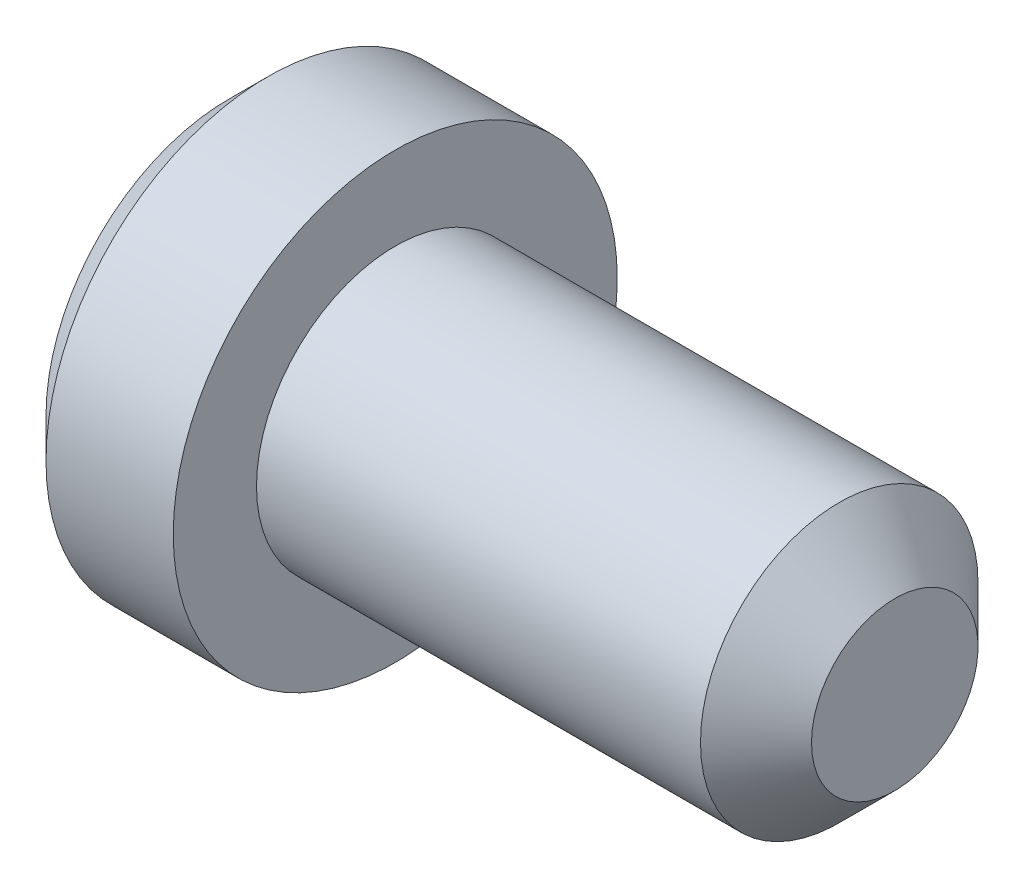
ISO-10303-21;
HEADER;
FILE_DESCRIPTION(('STEP AP214'),'2;1');
FILE_NAME('part.step','',(''),(''),'','','');
FILE_SCHEMA(('AUTOMOTIVE_DESIGN { 1 0 10303 214 1 1 1 1 }'));
ENDSEC;
DATA;
#1=APPLICATION_CONTEXT('core data for automotive mechanical design processes');
#2=APPLICATION_PROTOCOL_DEFINITION('international standard','automotive_design',2000,#1);
#3=PRODUCT_CONTEXT('',#1,'mechanical');
#4=PRODUCT('Part','Part','',(#3));
#5=PRODUCT_RELATED_PRODUCT_CATEGORY('part','',(#4));
#6=PRODUCT_DEFINITION_FORMATION('','',#4);
#7=PRODUCT_DEFINITION_CONTEXT('part definition',#1,'design');
#8=PRODUCT_DEFINITION('design','',#6,#7);
#9=PRODUCT_DEFINITION_SHAPE('','',#8);
#10=(LENGTH_UNIT() NAMED_UNIT(*) SI_UNIT(.MILLI.,.METRE.));
#11=(NAMED_UNIT(*) PLANE_ANGLE_UNIT() SI_UNIT($,.RADIAN.));
#12=(NAMED_UNIT(*) SI_UNIT($,.STERADIAN.) SOLID_ANGLE_UNIT());
#13=UNCERTAINTY_MEASURE_WITH_UNIT(LENGTH_MEASURE(1.E-05),#10,'distance_accuracy_value','');
#14=(GEOMETRIC_REPRESENTATION_CONTEXT(3) GLOBAL_UNCERTAINTY_ASSIGNED_CONTEXT((#13)) GLOBAL_UNIT_ASSIGNED_CONTEXT((#10,
#11,#12)) REPRESENTATION_CONTEXT('',''));
#15=CARTESIAN_POINT('',(0.,0.,0.));
#16=DIRECTION('',(0.,0.,1.));
#17=DIRECTION('',(1.,0.,0.));
#18=AXIS2_PLACEMENT_3D('',#15,#16,#17);
#19=CARTESIAN_POINT('',(-30.,0.,0.));
#20=DIRECTION('',(-1.,0.,0.));
#21=DIRECTION('',(0.,0.,1.));
#22=AXIS2_PLACEMENT_3D('',#19,#20,#21);
#23=PLANE('',#22);
#24=CARTESIAN_POINT('',(-30.,0.,0.));
#25=DIRECTION('',(-1.,0.,0.));
#26=DIRECTION('',(0.,0.,1.));
#27=AXIS2_PLACEMENT_3D('',#24,#25,#26);
#28=CIRCLE('',#27,32.9289321881345);
#29=CARTESIAN_POINT('',(-30.,0.,32.9289321881345));
#30=VERTEX_POINT('',#29);
#31=EDGE_CURVE('E10',#30,#30,#28,.T.);
#32=ORIENTED_EDGE('',*,*,#31,.T.);
#33=EDGE_LOOP('',(#32));
#34=FACE_BOUND('',#33,.T.);
#35=ADVANCED_FACE('F31',(#34),#23,.T.);
#36=CARTESIAN_POINT('',(-30.,0.,0.));
#37=DIRECTION('',(1.,0.,0.));
#38=DIRECTION('',(0.,0.,-1.));
#39=AXIS2_PLACEMENT_3D('',#36,#37,#38);
#40=CONICAL_SURFACE('',#39,32.9289321881345,0.785398163397447);
#41=CARTESIAN_POINT('',(-22.9289321881345,0.,0.));
#42=DIRECTION('',(-1.,0.,0.));
#43=DIRECTION('',(0.,0.,1.));
#44=AXIS2_PLACEMENT_3D('',#41,#42,#43);
#45=CIRCLE('',#44,40.);
#46=CARTESIAN_POINT('',(-22.9289321881345,0.,40.));
#47=VERTEX_POINT('',#46);
#48=EDGE_CURVE('E37',#47,#47,#45,.T.);
#49=ORIENTED_EDGE('',*,*,#48,.T.);
#50=EDGE_LOOP('',(#49));
#51=FACE_BOUND('',#50,.T.);
#52=ORIENTED_EDGE('',*,*,#31,.F.);
#53=EDGE_LOOP('',(#52));
#54=FACE_BOUND('',#53,.T.);
#55=ADVANCED_FACE('F69',(#51,#54),#40,.T.);
#56=CARTESIAN_POINT('',(-137.625060788734,0.,0.));
#57=DIRECTION('',(-1.,0.,0.));
#58=DIRECTION('',(0.,0.,1.));
#59=AXIS2_PLACEMENT_3D('',#56,#57,#58);
#60=CYLINDRICAL_SURFACE('',#59,40.);
#61=CARTESIAN_POINT('',(0.,0.,0.));
#62=DIRECTION('',(-1.,0.,0.));
#63=DIRECTION('',(0.,0.,1.));
#64=AXIS2_PLACEMENT_3D('',#61,#62,#63);
#65=CIRCLE('',#64,40.);
#66=CARTESIAN_POINT('',(0.,0.,40.));
#67=VERTEX_POINT('',#66);
#68=EDGE_CURVE('E41',#67,#67,#65,.T.);
#69=ORIENTED_EDGE('',*,*,#68,.T.);
#70=EDGE_LOOP('',(#69));
#71=FACE_BOUND('',#70,.T.);
#72=ORIENTED_EDGE('',*,*,#48,.F.);
#73=EDGE_LOOP('',(#72));
#74=FACE_BOUND('',#73,.T.);
#75=ADVANCED_FACE('F73',(#71,#74),#60,.T.);
#76=CARTESIAN_POINT('',(0.,-40.,0.));
#77=DIRECTION('',(1.,0.,0.));
#78=DIRECTION('',(0.,0.,-1.));
#79=AXIS2_PLACEMENT_3D('',#76,#77,#78);
#80=PLANE('',#79);
#81=CARTESIAN_POINT('',(0.,0.,0.));
#82=DIRECTION('',(-1.,0.,0.));
#83=DIRECTION('',(0.,0.,1.));
#84=AXIS2_PLACEMENT_3D('',#81,#82,#83);
#85=CIRCLE('',#84,25.);
#86=CARTESIAN_POINT('',(0.,0.,25.));
#87=VERTEX_POINT('',#86);
#88=EDGE_CURVE('E45',#87,#87,#85,.T.);
#89=ORIENTED_EDGE('',*,*,#88,.T.);
#90=EDGE_LOOP('',(#89));
#91=FACE_BOUND('',#90,.T.);
#92=ORIENTED_EDGE('',*,*,#68,.F.);
#93=EDGE_LOOP('',(#92));
#94=FACE_BOUND('',#93,.T.);
#95=ADVANCED_FACE('F77',(#91,#94),#80,.T.);
#96=CARTESIAN_POINT('',(-137.625060788734,0.,0.));
#97=DIRECTION('',(-1.,0.,0.));
#98=DIRECTION('',(0.,0.,1.));
#99=AXIS2_PLACEMENT_3D('',#96,#97,#98);
#100=CYLINDRICAL_SURFACE('',#99,25.);
#101=CARTESIAN_POINT('',(80.,0.,0.));
#102=DIRECTION('',(-1.,0.,0.));
#103=DIRECTION('',(0.,0.,1.));
#104=AXIS2_PLACEMENT_3D('',#101,#102,#103);
#105=CIRCLE('',#104,25.);
#106=CARTESIAN_POINT('',(80.,0.,25.));
#107=VERTEX_POINT('',#106);
#108=EDGE_CURVE('E50',#107,#107,#105,.T.);
#109=ORIENTED_EDGE('',*,*,#108,.T.);
#110=EDGE_LOOP('',(#109));
#111=FACE_BOUND('',#110,.T.);
#112=ORIENTED_EDGE('',*,*,#88,.F.);
#113=EDGE_LOOP('',(#112));
#114=FACE_BOUND('',#113,.T.);
#115=ADVANCED_FACE('F66',(#111,#114),#100,.T.);
#116=CARTESIAN_POINT('',(80.,0.,0.));
#117=DIRECTION('',(-1.,0.,0.));
#118=DIRECTION('',(0.,0.,1.));
#119=AXIS2_PLACEMENT_3D('',#116,#117,#118);
#120=CONICAL_SURFACE('',#119,25.,0.785398163397448);
#121=CARTESIAN_POINT('',(90.0000000000001,0.,0.));
#122=DIRECTION('',(-1.,0.,0.));
#123=DIRECTION('',(0.,0.,1.));
#124=AXIS2_PLACEMENT_3D('',#121,#122,#123);
#125=CIRCLE('',#124,15.);
#126=CARTESIAN_POINT('',(90.0000000000001,0.,15.));
#127=VERTEX_POINT('',#126);
#128=EDGE_CURVE('E53',#127,#127,#125,.T.);
#129=ORIENTED_EDGE('',*,*,#128,.T.);
#130=EDGE_LOOP('',(#129));
#131=FACE_BOUND('',#130,.T.);
#132=ORIENTED_EDGE('',*,*,#108,.F.);
#133=EDGE_LOOP('',(#132));
#134=FACE_BOUND('',#133,.T.);
#135=ADVANCED_FACE('F57',(#131,#134),#120,.T.);
#136=CARTESIAN_POINT('',(90.,-15.,0.));
#137=DIRECTION('',(1.,0.,0.));
#138=DIRECTION('',(0.,0.,-1.));
#139=AXIS2_PLACEMENT_3D('',#136,#137,#138);
#140=PLANE('',#139);
#141=ORIENTED_EDGE('',*,*,#128,.F.);
#142=EDGE_LOOP('',(#141));
#143=FACE_BOUND('',#142,.T.);
#144=ADVANCED_FACE('F60',(#143),#140,.T.);
#145=CLOSED_SHELL('',(#35,#55,#75,#95,#115,#135,#144));
#146=MANIFOLD_SOLID_BREP('B2',#145);
#147=ADVANCED_BREP_SHAPE_REPRESENTATION('',(#18,#146),#14);
#148=SHAPE_DEFINITION_REPRESENTATION(#9,#147);
ENDSEC;
END-ISO-10303-21;
